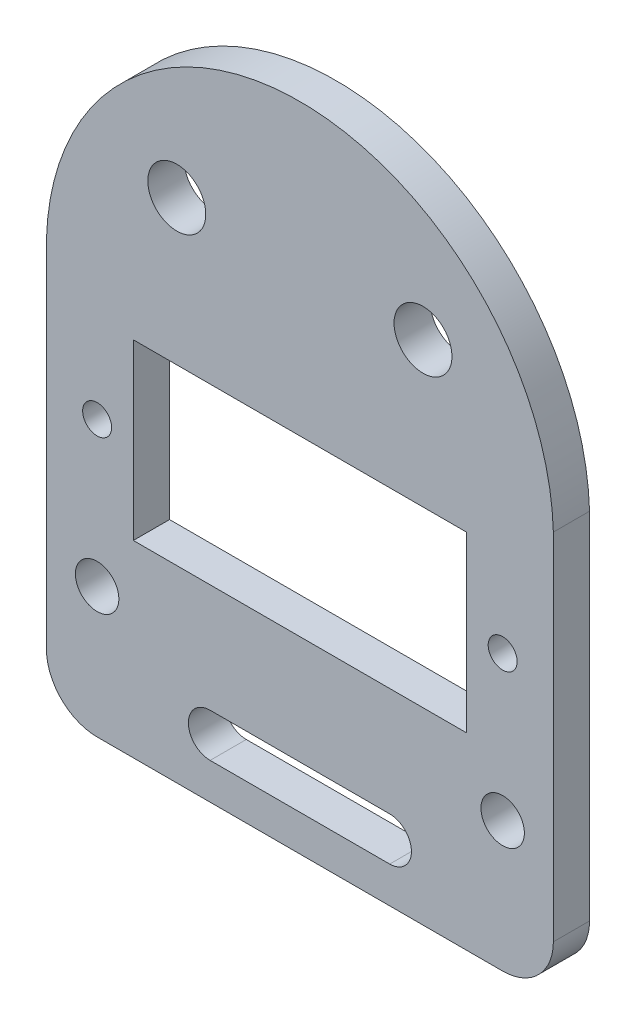
ISO-10303-21;
HEADER;
FILE_DESCRIPTION(('STEP AP214'),'2;1');
FILE_NAME('part.step','',(''),(''),'','','');
FILE_SCHEMA(('AUTOMOTIVE_DESIGN { 1 0 10303 214 1 1 1 1 }'));
ENDSEC;
DATA;
#1=APPLICATION_CONTEXT('core data for automotive mechanical design processes');
#2=APPLICATION_PROTOCOL_DEFINITION('international standard','automotive_design',2000,#1);
#3=PRODUCT_CONTEXT('',#1,'mechanical');
#4=PRODUCT('Part','Part','',(#3));
#5=PRODUCT_RELATED_PRODUCT_CATEGORY('part','',(#4));
#6=PRODUCT_DEFINITION_FORMATION('','',#4);
#7=PRODUCT_DEFINITION_CONTEXT('part definition',#1,'design');
#8=PRODUCT_DEFINITION('design','',#6,#7);
#9=PRODUCT_DEFINITION_SHAPE('','',#8);
#10=(LENGTH_UNIT() NAMED_UNIT(*) SI_UNIT(.MILLI.,.METRE.));
#11=(NAMED_UNIT(*) PLANE_ANGLE_UNIT() SI_UNIT($,.RADIAN.));
#12=(NAMED_UNIT(*) SI_UNIT($,.STERADIAN.) SOLID_ANGLE_UNIT());
#13=UNCERTAINTY_MEASURE_WITH_UNIT(LENGTH_MEASURE(1.E-05),#10,'distance_accuracy_value','');
#14=(GEOMETRIC_REPRESENTATION_CONTEXT(3) GLOBAL_UNCERTAINTY_ASSIGNED_CONTEXT((#13)) GLOBAL_UNIT_ASSIGNED_CONTEXT((#10,
#11,#12)) REPRESENTATION_CONTEXT('',''));
#15=CARTESIAN_POINT('',(0.,0.,0.));
#16=DIRECTION('',(0.,0.,1.));
#17=DIRECTION('',(1.,0.,0.));
#18=AXIS2_PLACEMENT_3D('',#15,#16,#17);
#19=CARTESIAN_POINT('',(0.,8.49264705882353,2.5));
#20=DIRECTION('',(0.,0.,-1.));
#21=DIRECTION('',(-1.,0.,0.));
#22=AXIS2_PLACEMENT_3D('',#19,#20,#21);
#23=PLANE('',#22);
#24=CARTESIAN_POINT('',(-14.,-10.,2.5));
#25=DIRECTION('',(0.,0.,1.));
#26=DIRECTION('',(1.,0.,0.));
#27=AXIS2_PLACEMENT_3D('',#24,#25,#26);
#28=CIRCLE('',#27,1.5);
#29=CARTESIAN_POINT('',(-12.5,-10.,2.5));
#30=VERTEX_POINT('',#29);
#31=EDGE_CURVE('E180',#30,#30,#28,.T.);
#32=ORIENTED_EDGE('',*,*,#31,.F.);
#33=EDGE_LOOP('',(#32));
#34=FACE_BOUND('',#33,.T.);
#35=CARTESIAN_POINT('',(-14.,0.,2.5));
#36=DIRECTION('',(0.,0.,1.));
#37=DIRECTION('',(1.,0.,0.));
#38=AXIS2_PLACEMENT_3D('',#35,#36,#37);
#39=CIRCLE('',#38,1.);
#40=CARTESIAN_POINT('',(-13.,0.,2.5));
#41=VERTEX_POINT('',#40);
#42=EDGE_CURVE('E186',#41,#41,#39,.T.);
#43=ORIENTED_EDGE('',*,*,#42,.F.);
#44=EDGE_LOOP('',(#43));
#45=FACE_BOUND('',#44,.T.);
#46=DIRECTION('',(0.,1.,0.));
#47=VECTOR('',#46,1.);
#48=CARTESIAN_POINT('',(11.5,6.,2.5));
#49=LINE('',#48,#47);
#50=CARTESIAN_POINT('',(11.5,-6.,2.5));
#51=VERTEX_POINT('',#50);
#52=CARTESIAN_POINT('',(11.5,6.,2.5));
#53=VERTEX_POINT('',#52);
#54=EDGE_CURVE('E192',#51,#53,#49,.T.);
#55=ORIENTED_EDGE('',*,*,#54,.F.);
#56=DIRECTION('',(1.,0.,0.));
#57=VECTOR('',#56,1.);
#58=CARTESIAN_POINT('',(-11.5,-6.,2.5));
#59=LINE('',#58,#57);
#60=CARTESIAN_POINT('',(-11.5,-6.,2.5));
#61=VERTEX_POINT('',#60);
#62=EDGE_CURVE('E200',#61,#51,#59,.T.);
#63=ORIENTED_EDGE('',*,*,#62,.F.);
#64=DIRECTION('',(0.,-1.,0.));
#65=VECTOR('',#64,1.);
#66=CARTESIAN_POINT('',(-11.5,6.,2.5));
#67=LINE('',#66,#65);
#68=CARTESIAN_POINT('',(-11.5,6.,2.5));
#69=VERTEX_POINT('',#68);
#70=EDGE_CURVE('E197',#69,#61,#67,.T.);
#71=ORIENTED_EDGE('',*,*,#70,.F.);
#72=DIRECTION('',(-1.,0.,0.));
#73=VECTOR('',#72,1.);
#74=CARTESIAN_POINT('',(-11.5,6.,2.5));
#75=LINE('',#74,#73);
#76=EDGE_CURVE('E194',#53,#69,#75,.T.);
#77=ORIENTED_EDGE('',*,*,#76,.F.);
#78=EDGE_LOOP('',(#55,#63,#71,#77));
#79=FACE_BOUND('',#78,.T.);
#80=DIRECTION('',(0.,-1.,0.));
#81=VECTOR('',#80,1.);
#82=CARTESIAN_POINT('',(-17.5,9.00000000000001,2.5));
#83=LINE('',#82,#81);
#84=CARTESIAN_POINT('',(-17.5,9.00000000000001,2.5));
#85=VERTEX_POINT('',#84);
#86=CARTESIAN_POINT('',(-17.5,-15.5,2.5));
#87=VERTEX_POINT('',#86);
#88=EDGE_CURVE('E226',#85,#87,#83,.T.);
#89=ORIENTED_EDGE('',*,*,#88,.T.);
#90=CARTESIAN_POINT('',(-14.,-15.5,2.5));
#91=DIRECTION('',(0.,0.,-1.));
#92=DIRECTION('',(-1.,0.,0.));
#93=AXIS2_PLACEMENT_3D('',#90,#91,#92);
#94=CIRCLE('',#93,3.5);
#95=CARTESIAN_POINT('',(-14.,-19.,2.5));
#96=VERTEX_POINT('',#95);
#97=EDGE_CURVE('E40',#87,#96,#94,.F.);
#98=ORIENTED_EDGE('',*,*,#97,.T.);
#99=DIRECTION('',(1.,0.,0.));
#100=VECTOR('',#99,1.);
#101=CARTESIAN_POINT('',(-17.5,-19.,2.5));
#102=LINE('',#101,#100);
#103=CARTESIAN_POINT('',(14.,-19.,2.5));
#104=VERTEX_POINT('',#103);
#105=EDGE_CURVE('E229',#96,#104,#102,.T.);
#106=ORIENTED_EDGE('',*,*,#105,.T.);
#107=CARTESIAN_POINT('',(14.,-15.5,2.5));
#108=DIRECTION('',(0.,0.,-1.));
#109=DIRECTION('',(-1.,0.,0.));
#110=AXIS2_PLACEMENT_3D('',#107,#108,#109);
#111=CIRCLE('',#110,3.5);
#112=CARTESIAN_POINT('',(17.5,-15.5,2.5));
#113=VERTEX_POINT('',#112);
#114=EDGE_CURVE('E47',#104,#113,#111,.F.);
#115=ORIENTED_EDGE('',*,*,#114,.T.);
#116=DIRECTION('',(0.,1.,0.));
#117=VECTOR('',#116,1.);
#118=CARTESIAN_POINT('',(17.5,9.00000000000001,2.5));
#119=LINE('',#118,#117);
#120=CARTESIAN_POINT('',(17.5,9.00000000000001,2.5));
#121=VERTEX_POINT('',#120);
#122=EDGE_CURVE('E231',#113,#121,#119,.T.);
#123=ORIENTED_EDGE('',*,*,#122,.T.);
#124=CARTESIAN_POINT('',(0.,8.49264705882353,2.5));
#125=DIRECTION('',(0.,0.,1.));
#126=DIRECTION('',(-1.,0.,0.));
#127=AXIS2_PLACEMENT_3D('',#124,#125,#126);
#128=CIRCLE('',#127,17.5073529411765);
#129=EDGE_CURVE('E223',#121,#85,#128,.T.);
#130=ORIENTED_EDGE('',*,*,#129,.T.);
#131=EDGE_LOOP('',(#89,#98,#106,#115,#123,#130));
#132=FACE_BOUND('',#131,.T.);
#133=CARTESIAN_POINT('',(-6.2,-15.,2.5));
#134=DIRECTION('',(0.,0.,1.));
#135=DIRECTION('',(1.,0.,0.));
#136=AXIS2_PLACEMENT_3D('',#133,#134,#135);
#137=CIRCLE('',#136,1.5);
#138=CARTESIAN_POINT('',(-6.2,-13.5,2.5));
#139=VERTEX_POINT('',#138);
#140=CARTESIAN_POINT('',(-6.2,-16.5,2.5));
#141=VERTEX_POINT('',#140);
#142=EDGE_CURVE('E136',#139,#141,#137,.T.);
#143=ORIENTED_EDGE('',*,*,#142,.F.);
#144=DIRECTION('',(-1.,0.,0.));
#145=VECTOR('',#144,1.);
#146=CARTESIAN_POINT('',(-6.2,-13.5,2.5));
#147=LINE('',#146,#145);
#148=CARTESIAN_POINT('',(6.2,-13.5,2.5));
#149=VERTEX_POINT('',#148);
#150=EDGE_CURVE('E162',#149,#139,#147,.T.);
#151=ORIENTED_EDGE('',*,*,#150,.F.);
#152=CARTESIAN_POINT('',(6.2,-15.,2.5));
#153=DIRECTION('',(0.,0.,1.));
#154=DIRECTION('',(1.,0.,0.));
#155=AXIS2_PLACEMENT_3D('',#152,#153,#154);
#156=CIRCLE('',#155,1.5);
#157=CARTESIAN_POINT('',(6.2,-16.5,2.5));
#158=VERTEX_POINT('',#157);
#159=EDGE_CURVE('E160',#158,#149,#156,.T.);
#160=ORIENTED_EDGE('',*,*,#159,.F.);
#161=DIRECTION('',(1.,0.,0.));
#162=VECTOR('',#161,1.);
#163=CARTESIAN_POINT('',(-6.2,-16.5,2.5));
#164=LINE('',#163,#162);
#165=EDGE_CURVE('E146',#141,#158,#164,.T.);
#166=ORIENTED_EDGE('',*,*,#165,.F.);
#167=EDGE_LOOP('',(#143,#151,#160,#166));
#168=FACE_BOUND('',#167,.T.);
#169=CARTESIAN_POINT('',(-8.5,16.,2.5));
#170=DIRECTION('',(0.,0.,1.));
#171=DIRECTION('',(1.,0.,0.));
#172=AXIS2_PLACEMENT_3D('',#169,#170,#171);
#173=CIRCLE('',#172,2.);
#174=CARTESIAN_POINT('',(-6.5,16.,2.5));
#175=VERTEX_POINT('',#174);
#176=EDGE_CURVE('E169',#175,#175,#173,.T.);
#177=ORIENTED_EDGE('',*,*,#176,.F.);
#178=EDGE_LOOP('',(#177));
#179=FACE_BOUND('',#178,.T.);
#180=CARTESIAN_POINT('',(14.,-10.,2.5));
#181=DIRECTION('',(0.,0.,1.));
#182=DIRECTION('',(-1.,0.,0.));
#183=AXIS2_PLACEMENT_3D('',#180,#181,#182);
#184=CIRCLE('',#183,1.5);
#185=CARTESIAN_POINT('',(12.5,-10.,2.5));
#186=VERTEX_POINT('',#185);
#187=EDGE_CURVE('E501',#186,#186,#184,.T.);
#188=ORIENTED_EDGE('',*,*,#187,.F.);
#189=EDGE_LOOP('',(#188));
#190=FACE_BOUND('',#189,.T.);
#191=CARTESIAN_POINT('',(14.,0.,2.5));
#192=DIRECTION('',(0.,0.,1.));
#193=DIRECTION('',(-1.,0.,0.));
#194=AXIS2_PLACEMENT_3D('',#191,#192,#193);
#195=CIRCLE('',#194,1.);
#196=CARTESIAN_POINT('',(13.,0.,2.5));
#197=VERTEX_POINT('',#196);
#198=EDGE_CURVE('E495',#197,#197,#195,.T.);
#199=ORIENTED_EDGE('',*,*,#198,.F.);
#200=EDGE_LOOP('',(#199));
#201=FACE_BOUND('',#200,.T.);
#202=CARTESIAN_POINT('',(8.5,16.,2.5));
#203=DIRECTION('',(0.,0.,1.));
#204=DIRECTION('',(-1.,0.,0.));
#205=AXIS2_PLACEMENT_3D('',#202,#203,#204);
#206=CIRCLE('',#205,2.);
#207=CARTESIAN_POINT('',(6.5,16.,2.5));
#208=VERTEX_POINT('',#207);
#209=EDGE_CURVE('E486',#208,#208,#206,.T.);
#210=ORIENTED_EDGE('',*,*,#209,.F.);
#211=EDGE_LOOP('',(#210));
#212=FACE_BOUND('',#211,.T.);
#213=ADVANCED_FACE('F32',(#34,#45,#79,#132,#168,#179,#190,#201,#212),#23,.F.);
#214=CARTESIAN_POINT('',(0.,8.49264705882353,0.));
#215=DIRECTION('',(0.,0.,-1.));
#216=DIRECTION('',(-1.,0.,0.));
#217=AXIS2_PLACEMENT_3D('',#214,#215,#216);
#218=PLANE('',#217);
#219=CARTESIAN_POINT('',(14.,0.,0.));
#220=DIRECTION('',(0.,0.,1.));
#221=DIRECTION('',(-1.,0.,0.));
#222=AXIS2_PLACEMENT_3D('',#219,#220,#221);
#223=CIRCLE('',#222,1.);
#224=CARTESIAN_POINT('',(13.,0.,0.));
#225=VERTEX_POINT('',#224);
#226=EDGE_CURVE('E492',#225,#225,#223,.T.);
#227=ORIENTED_EDGE('',*,*,#226,.T.);
#228=EDGE_LOOP('',(#227));
#229=FACE_BOUND('',#228,.T.);
#230=CARTESIAN_POINT('',(-8.5,16.,0.));
#231=DIRECTION('',(0.,0.,1.));
#232=DIRECTION('',(1.,0.,0.));
#233=AXIS2_PLACEMENT_3D('',#230,#231,#232);
#234=CIRCLE('',#233,2.);
#235=CARTESIAN_POINT('',(-6.5,16.,0.));
#236=VERTEX_POINT('',#235);
#237=EDGE_CURVE('E504',#236,#236,#234,.T.);
#238=ORIENTED_EDGE('',*,*,#237,.T.);
#239=EDGE_LOOP('',(#238));
#240=FACE_BOUND('',#239,.T.);
#241=CARTESIAN_POINT('',(-14.,0.,0.));
#242=DIRECTION('',(0.,0.,1.));
#243=DIRECTION('',(1.,0.,0.));
#244=AXIS2_PLACEMENT_3D('',#241,#242,#243);
#245=CIRCLE('',#244,1.);
#246=CARTESIAN_POINT('',(-13.,0.,0.));
#247=VERTEX_POINT('',#246);
#248=EDGE_CURVE('E183',#247,#247,#245,.T.);
#249=ORIENTED_EDGE('',*,*,#248,.T.);
#250=EDGE_LOOP('',(#249));
#251=FACE_BOUND('',#250,.T.);
#252=DIRECTION('',(1.,0.,0.));
#253=VECTOR('',#252,1.);
#254=CARTESIAN_POINT('',(-17.5,-19.,0.));
#255=LINE('',#254,#253);
#256=CARTESIAN_POINT('',(-14.,-19.,0.));
#257=VERTEX_POINT('',#256);
#258=CARTESIAN_POINT('',(14.,-19.,0.));
#259=VERTEX_POINT('',#258);
#260=EDGE_CURVE('E238',#257,#259,#255,.T.);
#261=ORIENTED_EDGE('',*,*,#260,.F.);
#262=CARTESIAN_POINT('',(-14.,-15.5,0.));
#263=DIRECTION('',(0.,0.,-1.));
#264=DIRECTION('',(-1.,0.,0.));
#265=AXIS2_PLACEMENT_3D('',#262,#263,#264);
#266=CIRCLE('',#265,3.5);
#267=CARTESIAN_POINT('',(-17.5,-15.5,0.));
#268=VERTEX_POINT('',#267);
#269=EDGE_CURVE('E254',#257,#268,#266,.T.);
#270=ORIENTED_EDGE('',*,*,#269,.T.);
#271=DIRECTION('',(0.,-1.,0.));
#272=VECTOR('',#271,1.);
#273=CARTESIAN_POINT('',(-17.5,9.00000000000001,0.));
#274=LINE('',#273,#272);
#275=CARTESIAN_POINT('',(-17.5,9.00000000000001,0.));
#276=VERTEX_POINT('',#275);
#277=EDGE_CURVE('E236',#276,#268,#274,.T.);
#278=ORIENTED_EDGE('',*,*,#277,.F.);
#279=CARTESIAN_POINT('',(0.,8.49264705882353,0.));
#280=DIRECTION('',(0.,0.,1.));
#281=DIRECTION('',(-1.,0.,0.));
#282=AXIS2_PLACEMENT_3D('',#279,#280,#281);
#283=CIRCLE('',#282,17.5073529411765);
#284=CARTESIAN_POINT('',(17.5,9.00000000000001,0.));
#285=VERTEX_POINT('',#284);
#286=EDGE_CURVE('E222',#285,#276,#283,.T.);
#287=ORIENTED_EDGE('',*,*,#286,.F.);
#288=DIRECTION('',(0.,1.,0.));
#289=VECTOR('',#288,1.);
#290=CARTESIAN_POINT('',(17.5,9.00000000000001,0.));
#291=LINE('',#290,#289);
#292=CARTESIAN_POINT('',(17.5,-15.5,0.));
#293=VERTEX_POINT('',#292);
#294=EDGE_CURVE('E227',#293,#285,#291,.T.);
#295=ORIENTED_EDGE('',*,*,#294,.F.);
#296=CARTESIAN_POINT('',(14.,-15.5,0.));
#297=DIRECTION('',(0.,0.,-1.));
#298=DIRECTION('',(-1.,0.,0.));
#299=AXIS2_PLACEMENT_3D('',#296,#297,#298);
#300=CIRCLE('',#299,3.5);
#301=EDGE_CURVE('E252',#293,#259,#300,.T.);
#302=ORIENTED_EDGE('',*,*,#301,.T.);
#303=EDGE_LOOP('',(#261,#270,#278,#287,#295,#302));
#304=FACE_BOUND('',#303,.T.);
#305=DIRECTION('',(1.,0.,0.));
#306=VECTOR('',#305,1.);
#307=CARTESIAN_POINT('',(-11.5,-6.,0.));
#308=LINE('',#307,#306);
#309=CARTESIAN_POINT('',(-11.5,-6.,0.));
#310=VERTEX_POINT('',#309);
#311=CARTESIAN_POINT('',(11.5,-6.,0.));
#312=VERTEX_POINT('',#311);
#313=EDGE_CURVE('E195',#310,#312,#308,.T.);
#314=ORIENTED_EDGE('',*,*,#313,.T.);
#315=DIRECTION('',(0.,1.,0.));
#316=VECTOR('',#315,1.);
#317=CARTESIAN_POINT('',(11.5,6.,0.));
#318=LINE('',#317,#316);
#319=CARTESIAN_POINT('',(11.5,6.,0.));
#320=VERTEX_POINT('',#319);
#321=EDGE_CURVE('E189',#312,#320,#318,.T.);
#322=ORIENTED_EDGE('',*,*,#321,.T.);
#323=DIRECTION('',(-1.,0.,0.));
#324=VECTOR('',#323,1.);
#325=CARTESIAN_POINT('',(-11.5,6.,0.));
#326=LINE('',#325,#324);
#327=CARTESIAN_POINT('',(-11.5,6.,0.));
#328=VERTEX_POINT('',#327);
#329=EDGE_CURVE('E205',#320,#328,#326,.T.);
#330=ORIENTED_EDGE('',*,*,#329,.T.);
#331=DIRECTION('',(0.,-1.,0.));
#332=VECTOR('',#331,1.);
#333=CARTESIAN_POINT('',(-11.5,6.,0.));
#334=LINE('',#333,#332);
#335=EDGE_CURVE('E208',#328,#310,#334,.T.);
#336=ORIENTED_EDGE('',*,*,#335,.T.);
#337=EDGE_LOOP('',(#314,#322,#330,#336));
#338=FACE_BOUND('',#337,.T.);
#339=CARTESIAN_POINT('',(-14.,-10.,0.));
#340=DIRECTION('',(0.,0.,1.));
#341=DIRECTION('',(1.,0.,0.));
#342=AXIS2_PLACEMENT_3D('',#339,#340,#341);
#343=CIRCLE('',#342,1.5);
#344=CARTESIAN_POINT('',(-12.5,-10.,0.));
#345=VERTEX_POINT('',#344);
#346=EDGE_CURVE('E154',#345,#345,#343,.T.);
#347=ORIENTED_EDGE('',*,*,#346,.T.);
#348=EDGE_LOOP('',(#347));
#349=FACE_BOUND('',#348,.T.);
#350=DIRECTION('',(-1.,0.,0.));
#351=VECTOR('',#350,1.);
#352=CARTESIAN_POINT('',(-6.2,-13.5,0.));
#353=LINE('',#352,#351);
#354=CARTESIAN_POINT('',(6.2,-13.5,0.));
#355=VERTEX_POINT('',#354);
#356=CARTESIAN_POINT('',(-6.2,-13.5,0.));
#357=VERTEX_POINT('',#356);
#358=EDGE_CURVE('E147',#355,#357,#353,.T.);
#359=ORIENTED_EDGE('',*,*,#358,.T.);
#360=CARTESIAN_POINT('',(-6.2,-15.,0.));
#361=DIRECTION('',(0.,0.,1.));
#362=DIRECTION('',(1.,0.,0.));
#363=AXIS2_PLACEMENT_3D('',#360,#361,#362);
#364=CIRCLE('',#363,1.5);
#365=CARTESIAN_POINT('',(-6.2,-16.5,0.));
#366=VERTEX_POINT('',#365);
#367=EDGE_CURVE('E167',#357,#366,#364,.T.);
#368=ORIENTED_EDGE('',*,*,#367,.T.);
#369=DIRECTION('',(1.,0.,0.));
#370=VECTOR('',#369,1.);
#371=CARTESIAN_POINT('',(-6.2,-16.5,0.));
#372=LINE('',#371,#370);
#373=CARTESIAN_POINT('',(6.2,-16.5,0.));
#374=VERTEX_POINT('',#373);
#375=EDGE_CURVE('E153',#366,#374,#372,.T.);
#376=ORIENTED_EDGE('',*,*,#375,.T.);
#377=CARTESIAN_POINT('',(6.2,-15.,0.));
#378=DIRECTION('',(0.,0.,1.));
#379=DIRECTION('',(1.,0.,0.));
#380=AXIS2_PLACEMENT_3D('',#377,#378,#379);
#381=CIRCLE('',#380,1.5);
#382=EDGE_CURVE('E171',#374,#355,#381,.T.);
#383=ORIENTED_EDGE('',*,*,#382,.T.);
#384=EDGE_LOOP('',(#359,#368,#376,#383));
#385=FACE_BOUND('',#384,.T.);
#386=CARTESIAN_POINT('',(14.,-10.,0.));
#387=DIRECTION('',(0.,0.,1.));
#388=DIRECTION('',(-1.,0.,0.));
#389=AXIS2_PLACEMENT_3D('',#386,#387,#388);
#390=CIRCLE('',#389,1.5);
#391=CARTESIAN_POINT('',(12.5,-10.,0.));
#392=VERTEX_POINT('',#391);
#393=EDGE_CURVE('E498',#392,#392,#390,.T.);
#394=ORIENTED_EDGE('',*,*,#393,.T.);
#395=EDGE_LOOP('',(#394));
#396=FACE_BOUND('',#395,.T.);
#397=CARTESIAN_POINT('',(8.5,16.,0.));
#398=DIRECTION('',(0.,0.,1.));
#399=DIRECTION('',(-1.,0.,0.));
#400=AXIS2_PLACEMENT_3D('',#397,#398,#399);
#401=CIRCLE('',#400,2.);
#402=CARTESIAN_POINT('',(6.5,16.,0.));
#403=VERTEX_POINT('',#402);
#404=EDGE_CURVE('E489',#403,#403,#401,.T.);
#405=ORIENTED_EDGE('',*,*,#404,.T.);
#406=EDGE_LOOP('',(#405));
#407=FACE_BOUND('',#406,.T.);
#408=ADVANCED_FACE('F267',(#229,#240,#251,#304,#338,#349,#385,#396,#407),#218,.T.);
#409=CARTESIAN_POINT('',(0.,8.49264705882353,2.5));
#410=DIRECTION('',(0.,0.,-1.));
#411=DIRECTION('',(-1.,0.,0.));
#412=AXIS2_PLACEMENT_3D('',#409,#410,#411);
#413=CYLINDRICAL_SURFACE('',#412,17.5073529411765);
#414=ORIENTED_EDGE('',*,*,#286,.T.);
#415=DIRECTION('',(0.,0.,-1.));
#416=VECTOR('',#415,1.);
#417=CARTESIAN_POINT('',(-17.5,9.00000000000001,2.5));
#418=LINE('',#417,#416);
#419=EDGE_CURVE('E244',#85,#276,#418,.T.);
#420=ORIENTED_EDGE('',*,*,#419,.F.);
#421=ORIENTED_EDGE('',*,*,#129,.F.);
#422=DIRECTION('',(0.,0.,-1.));
#423=VECTOR('',#422,1.);
#424=CARTESIAN_POINT('',(17.5,9.00000000000001,2.5));
#425=LINE('',#424,#423);
#426=EDGE_CURVE('E233',#121,#285,#425,.T.);
#427=ORIENTED_EDGE('',*,*,#426,.T.);
#428=EDGE_LOOP('',(#414,#420,#421,#427));
#429=FACE_BOUND('',#428,.T.);
#430=ADVANCED_FACE('F274',(#429),#413,.T.);
#431=CARTESIAN_POINT('',(-17.5,9.00000000000001,2.5));
#432=DIRECTION('',(1.,0.,0.));
#433=DIRECTION('',(0.,1.,0.));
#434=AXIS2_PLACEMENT_3D('',#431,#432,#433);
#435=PLANE('',#434);
#436=ORIENTED_EDGE('',*,*,#277,.T.);
#437=DIRECTION('',(0.,0.,-1.));
#438=VECTOR('',#437,1.);
#439=CARTESIAN_POINT('',(-17.5,-15.5,2.5));
#440=LINE('',#439,#438);
#441=EDGE_CURVE('E55',#268,#87,#440,.F.);
#442=ORIENTED_EDGE('',*,*,#441,.T.);
#443=ORIENTED_EDGE('',*,*,#88,.F.);
#444=ORIENTED_EDGE('',*,*,#419,.T.);
#445=EDGE_LOOP('',(#436,#442,#443,#444));
#446=FACE_BOUND('',#445,.T.);
#447=ADVANCED_FACE('F270',(#446),#435,.F.);
#448=CARTESIAN_POINT('',(-17.5,-19.,2.5));
#449=DIRECTION('',(0.,1.,0.));
#450=DIRECTION('',(-1.,0.,0.));
#451=AXIS2_PLACEMENT_3D('',#448,#449,#450);
#452=PLANE('',#451);
#453=ORIENTED_EDGE('',*,*,#105,.F.);
#454=DIRECTION('',(0.,0.,-1.));
#455=VECTOR('',#454,1.);
#456=CARTESIAN_POINT('',(-14.,-19.,2.5));
#457=LINE('',#456,#455);
#458=EDGE_CURVE('E249',#96,#257,#457,.T.);
#459=ORIENTED_EDGE('',*,*,#458,.T.);
#460=ORIENTED_EDGE('',*,*,#260,.T.);
#461=DIRECTION('',(0.,0.,-1.));
#462=VECTOR('',#461,1.);
#463=CARTESIAN_POINT('',(14.,-19.,2.5));
#464=LINE('',#463,#462);
#465=EDGE_CURVE('E247',#259,#104,#464,.F.);
#466=ORIENTED_EDGE('',*,*,#465,.T.);
#467=EDGE_LOOP('',(#453,#459,#460,#466));
#468=FACE_BOUND('',#467,.T.);
#469=ADVANCED_FACE('F262',(#468),#452,.F.);
#470=CARTESIAN_POINT('',(17.5,9.00000000000001,2.5));
#471=DIRECTION('',(-1.,0.,0.));
#472=DIRECTION('',(0.,-1.,0.));
#473=AXIS2_PLACEMENT_3D('',#470,#471,#472);
#474=PLANE('',#473);
#475=ORIENTED_EDGE('',*,*,#122,.F.);
#476=DIRECTION('',(0.,0.,-1.));
#477=VECTOR('',#476,1.);
#478=CARTESIAN_POINT('',(17.5,-15.5,2.5));
#479=LINE('',#478,#477);
#480=EDGE_CURVE('E11',#113,#293,#479,.T.);
#481=ORIENTED_EDGE('',*,*,#480,.T.);
#482=ORIENTED_EDGE('',*,*,#294,.T.);
#483=ORIENTED_EDGE('',*,*,#426,.F.);
#484=EDGE_LOOP('',(#475,#481,#482,#483));
#485=FACE_BOUND('',#484,.T.);
#486=ADVANCED_FACE('F278',(#485),#474,.F.);
#487=CARTESIAN_POINT('',(11.5,6.,2.5));
#488=DIRECTION('',(-1.,0.,0.));
#489=DIRECTION('',(0.,-1.,0.));
#490=AXIS2_PLACEMENT_3D('',#487,#488,#489);
#491=PLANE('',#490);
#492=ORIENTED_EDGE('',*,*,#321,.F.);
#493=DIRECTION('',(0.,0.,-1.));
#494=VECTOR('',#493,1.);
#495=CARTESIAN_POINT('',(11.5,-6.,2.5));
#496=LINE('',#495,#494);
#497=EDGE_CURVE('E202',#51,#312,#496,.T.);
#498=ORIENTED_EDGE('',*,*,#497,.F.);
#499=ORIENTED_EDGE('',*,*,#54,.T.);
#500=DIRECTION('',(0.,0.,-1.));
#501=VECTOR('',#500,1.);
#502=CARTESIAN_POINT('',(11.5,6.,2.5));
#503=LINE('',#502,#501);
#504=EDGE_CURVE('E219',#53,#320,#503,.T.);
#505=ORIENTED_EDGE('',*,*,#504,.T.);
#506=EDGE_LOOP('',(#492,#498,#499,#505));
#507=FACE_BOUND('',#506,.T.);
#508=ADVANCED_FACE('F297',(#507),#491,.T.);
#509=CARTESIAN_POINT('',(-11.5,6.,2.5));
#510=DIRECTION('',(0.,-1.,0.));
#511=DIRECTION('',(0.,0.,-1.));
#512=AXIS2_PLACEMENT_3D('',#509,#510,#511);
#513=PLANE('',#512);
#514=ORIENTED_EDGE('',*,*,#329,.F.);
#515=ORIENTED_EDGE('',*,*,#504,.F.);
#516=ORIENTED_EDGE('',*,*,#76,.T.);
#517=DIRECTION('',(0.,0.,-1.));
#518=VECTOR('',#517,1.);
#519=CARTESIAN_POINT('',(-11.5,6.,2.5));
#520=LINE('',#519,#518);
#521=EDGE_CURVE('E217',#69,#328,#520,.T.);
#522=ORIENTED_EDGE('',*,*,#521,.T.);
#523=EDGE_LOOP('',(#514,#515,#516,#522));
#524=FACE_BOUND('',#523,.T.);
#525=ADVANCED_FACE('F330',(#524),#513,.T.);
#526=CARTESIAN_POINT('',(-11.5,6.,2.5));
#527=DIRECTION('',(1.,0.,0.));
#528=DIRECTION('',(0.,1.,0.));
#529=AXIS2_PLACEMENT_3D('',#526,#527,#528);
#530=PLANE('',#529);
#531=ORIENTED_EDGE('',*,*,#335,.F.);
#532=ORIENTED_EDGE('',*,*,#521,.F.);
#533=ORIENTED_EDGE('',*,*,#70,.T.);
#534=DIRECTION('',(0.,0.,-1.));
#535=VECTOR('',#534,1.);
#536=CARTESIAN_POINT('',(-11.5,-6.,2.5));
#537=LINE('',#536,#535);
#538=EDGE_CURVE('E215',#61,#310,#537,.T.);
#539=ORIENTED_EDGE('',*,*,#538,.T.);
#540=EDGE_LOOP('',(#531,#532,#533,#539));
#541=FACE_BOUND('',#540,.T.);
#542=ADVANCED_FACE('F337',(#541),#530,.T.);
#543=CARTESIAN_POINT('',(-11.5,-6.,2.5));
#544=DIRECTION('',(0.,1.,0.));
#545=DIRECTION('',(0.,0.,1.));
#546=AXIS2_PLACEMENT_3D('',#543,#544,#545);
#547=PLANE('',#546);
#548=ORIENTED_EDGE('',*,*,#313,.F.);
#549=ORIENTED_EDGE('',*,*,#538,.F.);
#550=ORIENTED_EDGE('',*,*,#62,.T.);
#551=ORIENTED_EDGE('',*,*,#497,.T.);
#552=EDGE_LOOP('',(#548,#549,#550,#551));
#553=FACE_BOUND('',#552,.T.);
#554=ADVANCED_FACE('F344',(#553),#547,.T.);
#555=CARTESIAN_POINT('',(-14.,0.,2.5));
#556=DIRECTION('',(0.,0.,-1.));
#557=DIRECTION('',(-1.,0.,0.));
#558=AXIS2_PLACEMENT_3D('',#555,#556,#557);
#559=CYLINDRICAL_SURFACE('',#558,1.);
#560=ORIENTED_EDGE('',*,*,#42,.T.);
#561=EDGE_LOOP('',(#560));
#562=FACE_BOUND('',#561,.T.);
#563=ORIENTED_EDGE('',*,*,#248,.F.);
#564=EDGE_LOOP('',(#563));
#565=FACE_BOUND('',#564,.T.);
#566=ADVANCED_FACE('F352',(#562,#565),#559,.F.);
#567=CARTESIAN_POINT('',(-14.,-10.,2.5));
#568=DIRECTION('',(0.,0.,-1.));
#569=DIRECTION('',(-1.,0.,0.));
#570=AXIS2_PLACEMENT_3D('',#567,#568,#569);
#571=CYLINDRICAL_SURFACE('',#570,1.5);
#572=ORIENTED_EDGE('',*,*,#31,.T.);
#573=EDGE_LOOP('',(#572));
#574=FACE_BOUND('',#573,.T.);
#575=ORIENTED_EDGE('',*,*,#346,.F.);
#576=EDGE_LOOP('',(#575));
#577=FACE_BOUND('',#576,.T.);
#578=ADVANCED_FACE('F360',(#574,#577),#571,.F.);
#579=CARTESIAN_POINT('',(-6.2,-15.,2.5));
#580=DIRECTION('',(0.,0.,-1.));
#581=DIRECTION('',(-1.,0.,0.));
#582=AXIS2_PLACEMENT_3D('',#579,#580,#581);
#583=CYLINDRICAL_SURFACE('',#582,1.5);
#584=ORIENTED_EDGE('',*,*,#367,.F.);
#585=DIRECTION('',(0.,0.,-1.));
#586=VECTOR('',#585,1.);
#587=CARTESIAN_POINT('',(-6.2,-13.5,2.5));
#588=LINE('',#587,#586);
#589=EDGE_CURVE('E142',#139,#357,#588,.T.);
#590=ORIENTED_EDGE('',*,*,#589,.F.);
#591=ORIENTED_EDGE('',*,*,#142,.T.);
#592=DIRECTION('',(0.,0.,-1.));
#593=VECTOR('',#592,1.);
#594=CARTESIAN_POINT('',(-6.2,-16.5,2.5));
#595=LINE('',#594,#593);
#596=EDGE_CURVE('E139',#141,#366,#595,.T.);
#597=ORIENTED_EDGE('',*,*,#596,.T.);
#598=EDGE_LOOP('',(#584,#590,#591,#597));
#599=FACE_BOUND('',#598,.T.);
#600=ADVANCED_FACE('F138',(#599),#583,.F.);
#601=CARTESIAN_POINT('',(-6.2,-16.5,2.5));
#602=DIRECTION('',(0.,1.,0.));
#603=DIRECTION('',(0.,0.,1.));
#604=AXIS2_PLACEMENT_3D('',#601,#602,#603);
#605=PLANE('',#604);
#606=ORIENTED_EDGE('',*,*,#375,.F.);
#607=ORIENTED_EDGE('',*,*,#596,.F.);
#608=ORIENTED_EDGE('',*,*,#165,.T.);
#609=DIRECTION('',(0.,0.,-1.));
#610=VECTOR('',#609,1.);
#611=CARTESIAN_POINT('',(6.2,-16.5,2.5));
#612=LINE('',#611,#610);
#613=EDGE_CURVE('E155',#158,#374,#612,.T.);
#614=ORIENTED_EDGE('',*,*,#613,.T.);
#615=EDGE_LOOP('',(#606,#607,#608,#614));
#616=FACE_BOUND('',#615,.T.);
#617=ADVANCED_FACE('F150',(#616),#605,.T.);
#618=CARTESIAN_POINT('',(6.2,-15.,2.5));
#619=DIRECTION('',(0.,0.,-1.));
#620=DIRECTION('',(-1.,0.,0.));
#621=AXIS2_PLACEMENT_3D('',#618,#619,#620);
#622=CYLINDRICAL_SURFACE('',#621,1.5);
#623=ORIENTED_EDGE('',*,*,#382,.F.);
#624=ORIENTED_EDGE('',*,*,#613,.F.);
#625=ORIENTED_EDGE('',*,*,#159,.T.);
#626=DIRECTION('',(0.,0.,-1.));
#627=VECTOR('',#626,1.);
#628=CARTESIAN_POINT('',(6.2,-13.5,2.5));
#629=LINE('',#628,#627);
#630=EDGE_CURVE('E177',#149,#355,#629,.T.);
#631=ORIENTED_EDGE('',*,*,#630,.T.);
#632=EDGE_LOOP('',(#623,#624,#625,#631));
#633=FACE_BOUND('',#632,.T.);
#634=ADVANCED_FACE('F381',(#633),#622,.F.);
#635=CARTESIAN_POINT('',(-6.2,-13.5,2.5));
#636=DIRECTION('',(0.,-1.,0.));
#637=DIRECTION('',(0.,0.,-1.));
#638=AXIS2_PLACEMENT_3D('',#635,#636,#637);
#639=PLANE('',#638);
#640=ORIENTED_EDGE('',*,*,#358,.F.);
#641=ORIENTED_EDGE('',*,*,#630,.F.);
#642=ORIENTED_EDGE('',*,*,#150,.T.);
#643=ORIENTED_EDGE('',*,*,#589,.T.);
#644=EDGE_LOOP('',(#640,#641,#642,#643));
#645=FACE_BOUND('',#644,.T.);
#646=ADVANCED_FACE('F388',(#645),#639,.T.);
#647=CARTESIAN_POINT('',(-8.5,16.,2.5));
#648=DIRECTION('',(0.,0.,-1.));
#649=DIRECTION('',(-1.,0.,0.));
#650=AXIS2_PLACEMENT_3D('',#647,#648,#649);
#651=CYLINDRICAL_SURFACE('',#650,2.);
#652=ORIENTED_EDGE('',*,*,#176,.T.);
#653=EDGE_LOOP('',(#652));
#654=FACE_BOUND('',#653,.T.);
#655=ORIENTED_EDGE('',*,*,#237,.F.);
#656=EDGE_LOOP('',(#655));
#657=FACE_BOUND('',#656,.T.);
#658=ADVANCED_FACE('F396',(#654,#657),#651,.F.);
#659=CARTESIAN_POINT('',(14.,-10.,2.5));
#660=DIRECTION('',(0.,0.,-1.));
#661=DIRECTION('',(-1.,0.,0.));
#662=AXIS2_PLACEMENT_3D('',#659,#660,#661);
#663=CYLINDRICAL_SURFACE('',#662,1.5);
#664=ORIENTED_EDGE('',*,*,#187,.T.);
#665=EDGE_LOOP('',(#664));
#666=FACE_BOUND('',#665,.T.);
#667=ORIENTED_EDGE('',*,*,#393,.F.);
#668=EDGE_LOOP('',(#667));
#669=FACE_BOUND('',#668,.T.);
#670=ADVANCED_FACE('F404',(#666,#669),#663,.F.);
#671=CARTESIAN_POINT('',(14.,0.,2.5));
#672=DIRECTION('',(0.,0.,-1.));
#673=DIRECTION('',(-1.,0.,0.));
#674=AXIS2_PLACEMENT_3D('',#671,#672,#673);
#675=CYLINDRICAL_SURFACE('',#674,1.);
#676=ORIENTED_EDGE('',*,*,#198,.T.);
#677=EDGE_LOOP('',(#676));
#678=FACE_BOUND('',#677,.T.);
#679=ORIENTED_EDGE('',*,*,#226,.F.);
#680=EDGE_LOOP('',(#679));
#681=FACE_BOUND('',#680,.T.);
#682=ADVANCED_FACE('F412',(#678,#681),#675,.F.);
#683=CARTESIAN_POINT('',(8.5,16.,2.5));
#684=DIRECTION('',(0.,0.,-1.));
#685=DIRECTION('',(-1.,0.,0.));
#686=AXIS2_PLACEMENT_3D('',#683,#684,#685);
#687=CYLINDRICAL_SURFACE('',#686,2.);
#688=ORIENTED_EDGE('',*,*,#209,.T.);
#689=EDGE_LOOP('',(#688));
#690=FACE_BOUND('',#689,.T.);
#691=ORIENTED_EDGE('',*,*,#404,.F.);
#692=EDGE_LOOP('',(#691));
#693=FACE_BOUND('',#692,.T.);
#694=ADVANCED_FACE('F285',(#690,#693),#687,.F.);
#695=CARTESIAN_POINT('',(-14.,-15.5,2.5));
#696=DIRECTION('',(0.,0.,-1.));
#697=DIRECTION('',(-1.,0.,0.));
#698=AXIS2_PLACEMENT_3D('',#695,#696,#697);
#699=CYLINDRICAL_SURFACE('',#698,3.5);
#700=ORIENTED_EDGE('',*,*,#97,.F.);
#701=ORIENTED_EDGE('',*,*,#441,.F.);
#702=ORIENTED_EDGE('',*,*,#269,.F.);
#703=ORIENTED_EDGE('',*,*,#458,.F.);
#704=EDGE_LOOP('',(#700,#701,#702,#703));
#705=FACE_BOUND('',#704,.T.);
#706=ADVANCED_FACE('F265',(#705),#699,.T.);
#707=CARTESIAN_POINT('',(14.,-15.5,2.5));
#708=DIRECTION('',(0.,0.,-1.));
#709=DIRECTION('',(-1.,0.,0.));
#710=AXIS2_PLACEMENT_3D('',#707,#708,#709);
#711=CYLINDRICAL_SURFACE('',#710,3.5);
#712=ORIENTED_EDGE('',*,*,#114,.F.);
#713=ORIENTED_EDGE('',*,*,#465,.F.);
#714=ORIENTED_EDGE('',*,*,#301,.F.);
#715=ORIENTED_EDGE('',*,*,#480,.F.);
#716=EDGE_LOOP('',(#712,#713,#714,#715));
#717=FACE_BOUND('',#716,.T.);
#718=ADVANCED_FACE('F34',(#717),#711,.T.);
#719=CLOSED_SHELL('',(#213,#408,#430,#447,#469,#486,#508,#525,#542,#554,#566,#578,#600,#617,
#634,#646,#658,#670,#682,#694,#706,#718));
#720=MANIFOLD_SOLID_BREP('B2',#719);
#721=ADVANCED_BREP_SHAPE_REPRESENTATION('',(#18,#720),#14);
#722=SHAPE_DEFINITION_REPRESENTATION(#9,#721);
ENDSEC;
END-ISO-10303-21;
